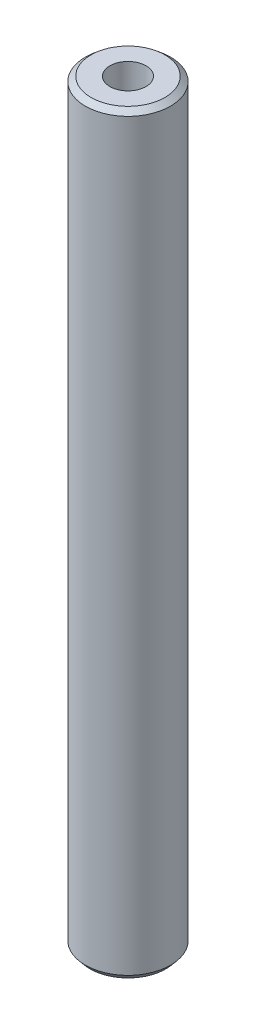
ISO-10303-21;
HEADER;
FILE_DESCRIPTION(('STEP AP214'),'2;1');
FILE_NAME('part.step','',(''),(''),'','','');
FILE_SCHEMA(('AUTOMOTIVE_DESIGN { 1 0 10303 214 1 1 1 1 }'));
ENDSEC;
DATA;
#1=APPLICATION_CONTEXT('core data for automotive mechanical design processes');
#2=APPLICATION_PROTOCOL_DEFINITION('international standard','automotive_design',2000,#1);
#3=PRODUCT_CONTEXT('',#1,'mechanical');
#4=PRODUCT('Part','Part','',(#3));
#5=PRODUCT_RELATED_PRODUCT_CATEGORY('part','',(#4));
#6=PRODUCT_DEFINITION_FORMATION('','',#4);
#7=PRODUCT_DEFINITION_CONTEXT('part definition',#1,'design');
#8=PRODUCT_DEFINITION('design','',#6,#7);
#9=PRODUCT_DEFINITION_SHAPE('','',#8);
#10=(LENGTH_UNIT() NAMED_UNIT(*) SI_UNIT(.MILLI.,.METRE.));
#11=(NAMED_UNIT(*) PLANE_ANGLE_UNIT() SI_UNIT($,.RADIAN.));
#12=(NAMED_UNIT(*) SI_UNIT($,.STERADIAN.) SOLID_ANGLE_UNIT());
#13=UNCERTAINTY_MEASURE_WITH_UNIT(LENGTH_MEASURE(1.E-05),#10,'distance_accuracy_value','');
#14=(GEOMETRIC_REPRESENTATION_CONTEXT(3) GLOBAL_UNCERTAINTY_ASSIGNED_CONTEXT((#13)) GLOBAL_UNIT_ASSIGNED_CONTEXT((#10,
#11,#12)) REPRESENTATION_CONTEXT('',''));
#15=CARTESIAN_POINT('',(0.,0.,0.));
#16=DIRECTION('',(0.,0.,1.));
#17=DIRECTION('',(1.,0.,0.));
#18=AXIS2_PLACEMENT_3D('',#15,#16,#17);
#19=CARTESIAN_POINT('',(0.,88.5992245968624,0.));
#20=DIRECTION('',(0.,-1.,0.));
#21=DIRECTION('',(0.,0.,-1.));
#22=AXIS2_PLACEMENT_3D('',#19,#20,#21);
#23=CYLINDRICAL_SURFACE('',#22,5.);
#24=CARTESIAN_POINT('',(0.,88.0458895550083,0.));
#25=DIRECTION('',(0.,1.,0.));
#26=DIRECTION('',(0.,0.,1.));
#27=AXIS2_PLACEMENT_3D('',#24,#25,#26);
#28=CIRCLE('',#27,5.);
#29=CARTESIAN_POINT('',(0.,88.0458895550083,5.));
#30=VERTEX_POINT('',#29);
#31=EDGE_CURVE('E50',#30,#30,#28,.F.);
#32=ORIENTED_EDGE('',*,*,#31,.T.);
#33=EDGE_LOOP('',(#32));
#34=FACE_BOUND('',#33,.T.);
#35=CARTESIAN_POINT('',(0.,0.660115916658002,0.));
#36=DIRECTION('',(0.,1.,0.));
#37=DIRECTION('',(0.,0.,1.));
#38=AXIS2_PLACEMENT_3D('',#35,#36,#37);
#39=CIRCLE('',#38,5.);
#40=CARTESIAN_POINT('',(0.,0.660115916658002,5.));
#41=VERTEX_POINT('',#40);
#42=EDGE_CURVE('E51',#41,#41,#39,.T.);
#43=ORIENTED_EDGE('',*,*,#42,.T.);
#44=EDGE_LOOP('',(#43));
#45=FACE_BOUND('',#44,.T.);
#46=ADVANCED_FACE('F39',(#34,#45),#23,.T.);
#47=CARTESIAN_POINT('',(0.,88.5992245968624,0.));
#48=DIRECTION('',(0.,1.,0.));
#49=DIRECTION('',(0.,0.,1.));
#50=AXIS2_PLACEMENT_3D('',#47,#48,#49);
#51=PLANE('',#50);
#52=CARTESIAN_POINT('',(0.,88.5992245968624,0.));
#53=DIRECTION('',(0.,1.,0.));
#54=DIRECTION('',(0.,0.,1.));
#55=AXIS2_PLACEMENT_3D('',#52,#53,#54);
#56=CIRCLE('',#55,4.33988408334203);
#57=CARTESIAN_POINT('',(0.,88.5992245968624,4.33988408334203));
#58=VERTEX_POINT('',#57);
#59=EDGE_CURVE('E54',#58,#58,#56,.T.);
#60=ORIENTED_EDGE('',*,*,#59,.T.);
#61=EDGE_LOOP('',(#60));
#62=FACE_BOUND('',#61,.T.);
#63=CARTESIAN_POINT('',(0.,88.5992245968624,0.));
#64=DIRECTION('',(0.,1.,0.));
#65=DIRECTION('',(0.,0.,1.));
#66=AXIS2_PLACEMENT_3D('',#63,#64,#65);
#67=CIRCLE('',#66,2.12109807521757);
#68=CARTESIAN_POINT('',(0.,88.5992245968624,2.12109807521757));
#69=VERTEX_POINT('',#68);
#70=EDGE_CURVE('E58',#69,#69,#67,.T.);
#71=ORIENTED_EDGE('',*,*,#70,.F.);
#72=EDGE_LOOP('',(#71));
#73=FACE_BOUND('',#72,.T.);
#74=ADVANCED_FACE('F69',(#62,#73),#51,.T.);
#75=CARTESIAN_POINT('',(0.,0.,0.));
#76=DIRECTION('',(0.,1.,0.));
#77=DIRECTION('',(0.,0.,1.));
#78=AXIS2_PLACEMENT_3D('',#75,#76,#77);
#79=PLANE('',#78);
#80=CARTESIAN_POINT('',(0.,0.,0.));
#81=DIRECTION('',(0.,1.,0.));
#82=DIRECTION('',(0.,0.,1.));
#83=AXIS2_PLACEMENT_3D('',#80,#81,#82);
#84=CIRCLE('',#83,4.44666495814589);
#85=CARTESIAN_POINT('',(0.,0.,4.44666495814589));
#86=VERTEX_POINT('',#85);
#87=EDGE_CURVE('E10',#86,#86,#84,.F.);
#88=ORIENTED_EDGE('',*,*,#87,.T.);
#89=EDGE_LOOP('',(#88));
#90=FACE_BOUND('',#89,.T.);
#91=CARTESIAN_POINT('',(0.,0.,0.));
#92=DIRECTION('',(0.,1.,0.));
#93=DIRECTION('',(0.,0.,1.));
#94=AXIS2_PLACEMENT_3D('',#91,#92,#93);
#95=CIRCLE('',#94,2.12109807521757);
#96=CARTESIAN_POINT('',(0.,0.,2.12109807521757));
#97=VERTEX_POINT('',#96);
#98=EDGE_CURVE('E63',#97,#97,#95,.T.);
#99=ORIENTED_EDGE('',*,*,#98,.T.);
#100=EDGE_LOOP('',(#99));
#101=FACE_BOUND('',#100,.T.);
#102=ADVANCED_FACE('F75',(#90,#101),#79,.F.);
#103=CARTESIAN_POINT('',(0.,88.5992245968624,0.));
#104=DIRECTION('',(0.,-1.,0.));
#105=DIRECTION('',(0.,0.,-1.));
#106=AXIS2_PLACEMENT_3D('',#103,#104,#105);
#107=CYLINDRICAL_SURFACE('',#106,2.12109807521757);
#108=ORIENTED_EDGE('',*,*,#70,.T.);
#109=EDGE_LOOP('',(#108));
#110=FACE_BOUND('',#109,.T.);
#111=ORIENTED_EDGE('',*,*,#98,.F.);
#112=EDGE_LOOP('',(#111));
#113=FACE_BOUND('',#112,.T.);
#114=ADVANCED_FACE('F70',(#110,#113),#107,.F.);
#115=CARTESIAN_POINT('',(0.,88.5992245968624,0.));
#116=DIRECTION('',(0.,-1.,0.));
#117=DIRECTION('',(0.,0.,-1.));
#118=AXIS2_PLACEMENT_3D('',#115,#116,#117);
#119=CONICAL_SURFACE('',#118,4.33988408334203,0.873169758181615);
#120=ORIENTED_EDGE('',*,*,#31,.F.);
#121=EDGE_LOOP('',(#120));
#122=FACE_BOUND('',#121,.T.);
#123=ORIENTED_EDGE('',*,*,#59,.F.);
#124=EDGE_LOOP('',(#123));
#125=FACE_BOUND('',#124,.T.);
#126=ADVANCED_FACE('F81',(#122,#125),#119,.T.);
#127=CARTESIAN_POINT('',(0.,0.660115916658002,0.));
#128=DIRECTION('',(0.,1.,0.));
#129=DIRECTION('',(0.,0.,1.));
#130=AXIS2_PLACEMENT_3D('',#127,#128,#129);
#131=CONICAL_SURFACE('',#130,5.,0.697626568613273);
#132=ORIENTED_EDGE('',*,*,#87,.F.);
#133=EDGE_LOOP('',(#132));
#134=FACE_BOUND('',#133,.T.);
#135=ORIENTED_EDGE('',*,*,#42,.F.);
#136=EDGE_LOOP('',(#135));
#137=FACE_BOUND('',#136,.T.);
#138=ADVANCED_FACE('F45',(#134,#137),#131,.T.);
#139=CLOSED_SHELL('',(#46,#74,#102,#114,#126,#138));
#140=MANIFOLD_SOLID_BREP('B2',#139);
#141=ADVANCED_BREP_SHAPE_REPRESENTATION('',(#18,#140),#14);
#142=SHAPE_DEFINITION_REPRESENTATION(#9,#141);
ENDSEC;
END-ISO-10303-21;
